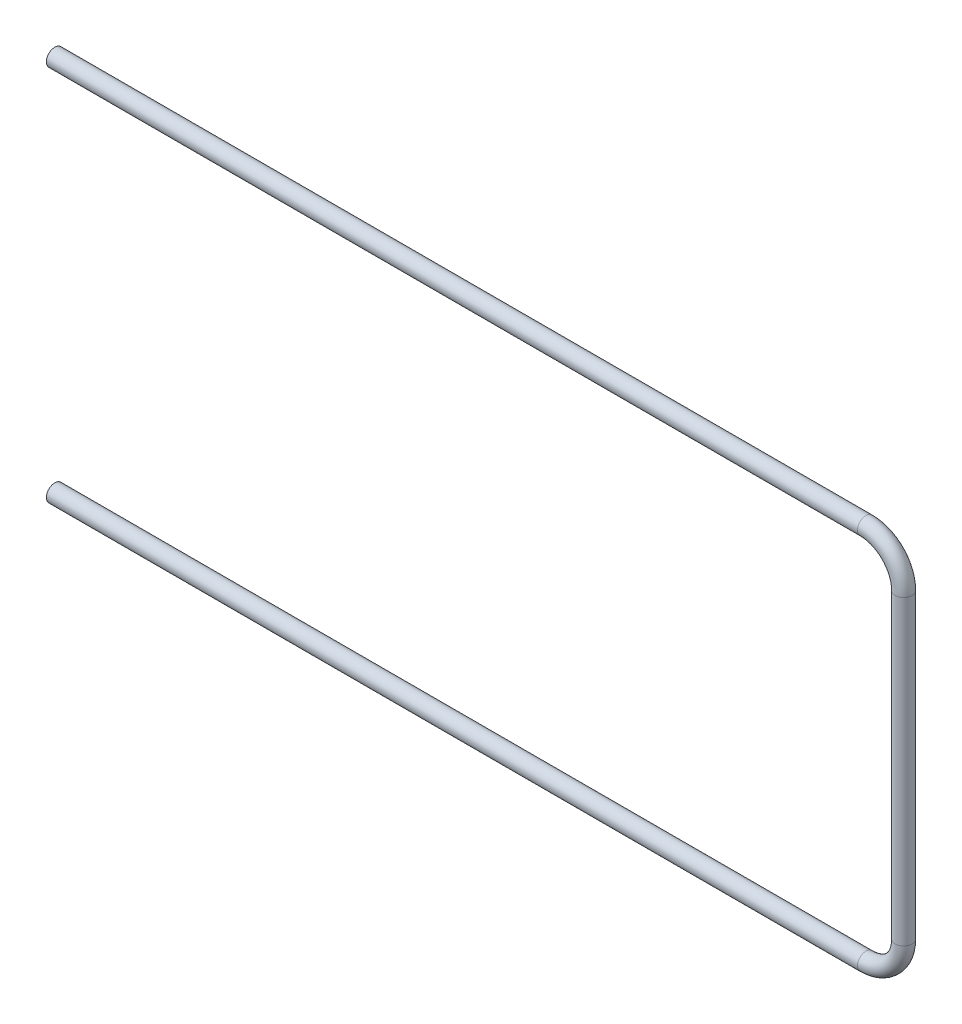
ISO-10303-21;
HEADER;
FILE_DESCRIPTION(('STEP AP214'),'2;1');
FILE_NAME('part.step','',(''),(''),'','','');
FILE_SCHEMA(('AUTOMOTIVE_DESIGN { 1 0 10303 214 1 1 1 1 }'));
ENDSEC;
DATA;
#1=APPLICATION_CONTEXT('core data for automotive mechanical design processes');
#2=APPLICATION_PROTOCOL_DEFINITION('international standard','automotive_design',2000,#1);
#3=PRODUCT_CONTEXT('',#1,'mechanical');
#4=PRODUCT('Part','Part','',(#3));
#5=PRODUCT_RELATED_PRODUCT_CATEGORY('part','',(#4));
#6=PRODUCT_DEFINITION_FORMATION('','',#4);
#7=PRODUCT_DEFINITION_CONTEXT('part definition',#1,'design');
#8=PRODUCT_DEFINITION('design','',#6,#7);
#9=PRODUCT_DEFINITION_SHAPE('','',#8);
#10=(LENGTH_UNIT() NAMED_UNIT(*) SI_UNIT(.MILLI.,.METRE.));
#11=(NAMED_UNIT(*) PLANE_ANGLE_UNIT() SI_UNIT($,.RADIAN.));
#12=(NAMED_UNIT(*) SI_UNIT($,.STERADIAN.) SOLID_ANGLE_UNIT());
#13=UNCERTAINTY_MEASURE_WITH_UNIT(LENGTH_MEASURE(1.E-05),#10,'distance_accuracy_value','');
#14=(GEOMETRIC_REPRESENTATION_CONTEXT(3) GLOBAL_UNCERTAINTY_ASSIGNED_CONTEXT((#13)) GLOBAL_UNIT_ASSIGNED_CONTEXT((#10,
#11,#12)) REPRESENTATION_CONTEXT('',''));
#15=CARTESIAN_POINT('',(0.,0.,0.));
#16=DIRECTION('',(0.,0.,1.));
#17=DIRECTION('',(1.,0.,0.));
#18=AXIS2_PLACEMENT_3D('',#15,#16,#17);
#19=CARTESIAN_POINT('',(430.,-200.,0.));
#20=DIRECTION('',(-1.,0.,0.));
#21=DIRECTION('',(0.,-1.,0.));
#22=AXIS2_PLACEMENT_3D('',#19,#20,#21);
#23=CYLINDRICAL_SURFACE('',#22,4.5);
#24=CARTESIAN_POINT('',(430.,-200.,0.));
#25=DIRECTION('',(-1.,0.,0.));
#26=DIRECTION('',(0.,0.,-1.));
#27=AXIS2_PLACEMENT_3D('',#24,#25,#26);
#28=CIRCLE('',#27,4.5);
#29=CARTESIAN_POINT('',(430.,-204.5,0.));
#30=VERTEX_POINT('',#29);
#31=EDGE_CURVE('E50',#30,#30,#28,.T.);
#32=ORIENTED_EDGE('',*,*,#31,.T.);
#33=EDGE_LOOP('',(#32));
#34=FACE_BOUND('',#33,.T.);
#35=CARTESIAN_POINT('',(0.,-200.,0.));
#36=DIRECTION('',(-1.,0.,0.));
#37=DIRECTION('',(0.,0.,-1.));
#38=AXIS2_PLACEMENT_3D('',#35,#36,#37);
#39=CIRCLE('',#38,4.5);
#40=CARTESIAN_POINT('',(0.,-200.,-4.5));
#41=VERTEX_POINT('',#40);
#42=EDGE_CURVE('E12',#41,#41,#39,.T.);
#43=ORIENTED_EDGE('',*,*,#42,.F.);
#44=EDGE_LOOP('',(#43));
#45=FACE_BOUND('',#44,.T.);
#46=ADVANCED_FACE('F40',(#34,#45),#23,.T.);
#47=CARTESIAN_POINT('',(430.,-200.,0.));
#48=DIRECTION('',(-1.,0.,0.));
#49=DIRECTION('',(0.,-1.,0.));
#50=AXIS2_PLACEMENT_3D('',#47,#48,#49);
#51=CYLINDRICAL_SURFACE('',#50,2.5);
#52=CARTESIAN_POINT('',(430.,-200.,0.));
#53=DIRECTION('',(-1.,0.,0.));
#54=DIRECTION('',(0.,0.,-1.));
#55=AXIS2_PLACEMENT_3D('',#52,#53,#54);
#56=CIRCLE('',#55,2.5);
#57=CARTESIAN_POINT('',(430.,-202.5,0.));
#58=VERTEX_POINT('',#57);
#59=EDGE_CURVE('E54',#58,#58,#56,.T.);
#60=ORIENTED_EDGE('',*,*,#59,.F.);
#61=EDGE_LOOP('',(#60));
#62=FACE_BOUND('',#61,.T.);
#63=CARTESIAN_POINT('',(0.,-200.,0.));
#64=DIRECTION('',(-1.,0.,0.));
#65=DIRECTION('',(0.,0.,-1.));
#66=AXIS2_PLACEMENT_3D('',#63,#64,#65);
#67=CIRCLE('',#66,2.5);
#68=CARTESIAN_POINT('',(0.,-200.,-2.5));
#69=VERTEX_POINT('',#68);
#70=EDGE_CURVE('E46',#69,#69,#67,.T.);
#71=ORIENTED_EDGE('',*,*,#70,.T.);
#72=EDGE_LOOP('',(#71));
#73=FACE_BOUND('',#72,.T.);
#74=ADVANCED_FACE('F108',(#62,#73),#51,.F.);
#75=CARTESIAN_POINT('',(430.,-180.,0.));
#76=DIRECTION('',(0.,0.,-1.));
#77=DIRECTION('',(-1.,0.,0.));
#78=AXIS2_PLACEMENT_3D('',#75,#76,#77);
#79=TOROIDAL_SURFACE('',#78,20.,4.5);
#80=CARTESIAN_POINT('',(450.,-180.,0.));
#81=DIRECTION('',(0.,-1.,0.));
#82=DIRECTION('',(0.,0.,-1.));
#83=AXIS2_PLACEMENT_3D('',#80,#81,#82);
#84=CIRCLE('',#83,4.5);
#85=CARTESIAN_POINT('',(454.5,-180.,0.));
#86=VERTEX_POINT('',#85);
#87=EDGE_CURVE('E59',#86,#86,#84,.T.);
#88=CARTESIAN_POINT('',(430.,-180.,0.));
#89=DIRECTION('',(0.,0.,-1.));
#90=DIRECTION('',(-1.,0.,0.));
#91=AXIS2_PLACEMENT_3D('',#88,#89,#90);
#92=CIRCLE('',#91,24.5);
#93=EDGE_CURVE('',#86,#30,#92,.T.);
#94=ORIENTED_EDGE('',*,*,#87,.T.);
#95=ORIENTED_EDGE('',*,*,#31,.F.);
#96=ORIENTED_EDGE('',*,*,#93,.T.);
#97=ORIENTED_EDGE('',*,*,#93,.F.);
#98=EDGE_LOOP('',(#94,#96,#95,#97));
#99=FACE_BOUND('',#98,.T.);
#100=ADVANCED_FACE('F104',(#99),#79,.T.);
#101=CARTESIAN_POINT('',(430.,-180.,0.));
#102=DIRECTION('',(0.,0.,-1.));
#103=DIRECTION('',(-1.,0.,0.));
#104=AXIS2_PLACEMENT_3D('',#101,#102,#103);
#105=TOROIDAL_SURFACE('',#104,20.,2.5);
#106=CARTESIAN_POINT('',(450.,-180.,0.));
#107=DIRECTION('',(0.,-1.,0.));
#108=DIRECTION('',(0.,0.,-1.));
#109=AXIS2_PLACEMENT_3D('',#106,#107,#108);
#110=CIRCLE('',#109,2.5);
#111=CARTESIAN_POINT('',(452.5,-180.,0.));
#112=VERTEX_POINT('',#111);
#113=EDGE_CURVE('E62',#112,#112,#110,.T.);
#114=CARTESIAN_POINT('',(430.,-180.,0.));
#115=DIRECTION('',(0.,0.,-1.));
#116=DIRECTION('',(-1.,0.,0.));
#117=AXIS2_PLACEMENT_3D('',#114,#115,#116);
#118=CIRCLE('',#117,22.5);
#119=EDGE_CURVE('',#112,#58,#118,.T.);
#120=ORIENTED_EDGE('',*,*,#113,.F.);
#121=ORIENTED_EDGE('',*,*,#59,.T.);
#122=ORIENTED_EDGE('',*,*,#119,.T.);
#123=ORIENTED_EDGE('',*,*,#119,.F.);
#124=EDGE_LOOP('',(#120,#122,#121,#123));
#125=FACE_BOUND('',#124,.T.);
#126=ADVANCED_FACE('F101',(#125),#105,.F.);
#127=CARTESIAN_POINT('',(450.,-20.,0.));
#128=DIRECTION('',(0.,-1.,0.));
#129=DIRECTION('',(1.,0.,0.));
#130=AXIS2_PLACEMENT_3D('',#127,#128,#129);
#131=CYLINDRICAL_SURFACE('',#130,4.5);
#132=CARTESIAN_POINT('',(450.,-20.,0.));
#133=DIRECTION('',(0.,-1.,0.));
#134=DIRECTION('',(0.,0.,-1.));
#135=AXIS2_PLACEMENT_3D('',#132,#133,#134);
#136=CIRCLE('',#135,4.5);
#137=CARTESIAN_POINT('',(454.5,-20.,0.));
#138=VERTEX_POINT('',#137);
#139=EDGE_CURVE('E65',#138,#138,#136,.T.);
#140=ORIENTED_EDGE('',*,*,#139,.T.);
#141=EDGE_LOOP('',(#140));
#142=FACE_BOUND('',#141,.T.);
#143=ORIENTED_EDGE('',*,*,#87,.F.);
#144=EDGE_LOOP('',(#143));
#145=FACE_BOUND('',#144,.T.);
#146=ADVANCED_FACE('F97',(#142,#145),#131,.T.);
#147=CARTESIAN_POINT('',(450.,-20.,0.));
#148=DIRECTION('',(0.,-1.,0.));
#149=DIRECTION('',(1.,0.,0.));
#150=AXIS2_PLACEMENT_3D('',#147,#148,#149);
#151=CYLINDRICAL_SURFACE('',#150,2.5);
#152=CARTESIAN_POINT('',(450.,-20.,0.));
#153=DIRECTION('',(0.,-1.,0.));
#154=DIRECTION('',(0.,0.,-1.));
#155=AXIS2_PLACEMENT_3D('',#152,#153,#154);
#156=CIRCLE('',#155,2.5);
#157=CARTESIAN_POINT('',(452.5,-20.,0.));
#158=VERTEX_POINT('',#157);
#159=EDGE_CURVE('E68',#158,#158,#156,.T.);
#160=ORIENTED_EDGE('',*,*,#159,.F.);
#161=EDGE_LOOP('',(#160));
#162=FACE_BOUND('',#161,.T.);
#163=ORIENTED_EDGE('',*,*,#113,.T.);
#164=EDGE_LOOP('',(#163));
#165=FACE_BOUND('',#164,.T.);
#166=ADVANCED_FACE('F94',(#162,#165),#151,.F.);
#167=CARTESIAN_POINT('',(430.,-20.,0.));
#168=DIRECTION('',(0.,0.,-1.));
#169=DIRECTION('',(-1.,0.,0.));
#170=AXIS2_PLACEMENT_3D('',#167,#168,#169);
#171=TOROIDAL_SURFACE('',#170,20.,4.5);
#172=CARTESIAN_POINT('',(430.,0.,0.));
#173=DIRECTION('',(1.,0.,0.));
#174=DIRECTION('',(0.,0.,-1.));
#175=AXIS2_PLACEMENT_3D('',#172,#173,#174);
#176=CIRCLE('',#175,4.5);
#177=CARTESIAN_POINT('',(430.,4.5,0.));
#178=VERTEX_POINT('',#177);
#179=EDGE_CURVE('E71',#178,#178,#176,.T.);
#180=CARTESIAN_POINT('',(430.,-20.,0.));
#181=DIRECTION('',(0.,0.,-1.));
#182=DIRECTION('',(-1.,0.,0.));
#183=AXIS2_PLACEMENT_3D('',#180,#181,#182);
#184=CIRCLE('',#183,24.5);
#185=EDGE_CURVE('',#178,#138,#184,.T.);
#186=ORIENTED_EDGE('',*,*,#179,.T.);
#187=ORIENTED_EDGE('',*,*,#139,.F.);
#188=ORIENTED_EDGE('',*,*,#185,.T.);
#189=ORIENTED_EDGE('',*,*,#185,.F.);
#190=EDGE_LOOP('',(#186,#188,#187,#189));
#191=FACE_BOUND('',#190,.T.);
#192=ADVANCED_FACE('F90',(#191),#171,.T.);
#193=CARTESIAN_POINT('',(430.,-20.,0.));
#194=DIRECTION('',(0.,0.,-1.));
#195=DIRECTION('',(-1.,0.,0.));
#196=AXIS2_PLACEMENT_3D('',#193,#194,#195);
#197=TOROIDAL_SURFACE('',#196,20.,2.5);
#198=CARTESIAN_POINT('',(430.,0.,0.));
#199=DIRECTION('',(1.,0.,0.));
#200=DIRECTION('',(0.,0.,-1.));
#201=AXIS2_PLACEMENT_3D('',#198,#199,#200);
#202=CIRCLE('',#201,2.5);
#203=CARTESIAN_POINT('',(430.,2.5,0.));
#204=VERTEX_POINT('',#203);
#205=EDGE_CURVE('E75',#204,#204,#202,.T.);
#206=CARTESIAN_POINT('',(430.,-20.,0.));
#207=DIRECTION('',(0.,0.,-1.));
#208=DIRECTION('',(-1.,0.,0.));
#209=AXIS2_PLACEMENT_3D('',#206,#207,#208);
#210=CIRCLE('',#209,22.5);
#211=EDGE_CURVE('',#204,#158,#210,.T.);
#212=ORIENTED_EDGE('',*,*,#205,.F.);
#213=ORIENTED_EDGE('',*,*,#159,.T.);
#214=ORIENTED_EDGE('',*,*,#211,.T.);
#215=ORIENTED_EDGE('',*,*,#211,.F.);
#216=EDGE_LOOP('',(#212,#214,#213,#215));
#217=FACE_BOUND('',#216,.T.);
#218=ADVANCED_FACE('F87',(#217),#197,.F.);
#219=CARTESIAN_POINT('',(430.,0.,0.));
#220=DIRECTION('',(-1.,0.,0.));
#221=DIRECTION('',(0.,0.,1.));
#222=AXIS2_PLACEMENT_3D('',#219,#220,#221);
#223=CYLINDRICAL_SURFACE('',#222,2.5);
#224=ORIENTED_EDGE('',*,*,#205,.T.);
#225=EDGE_LOOP('',(#224));
#226=FACE_BOUND('',#225,.T.);
#227=CARTESIAN_POINT('',(0.,0.,0.));
#228=DIRECTION('',(1.,0.,0.));
#229=DIRECTION('',(0.,0.,-1.));
#230=AXIS2_PLACEMENT_3D('',#227,#228,#229);
#231=CIRCLE('',#230,2.5);
#232=CARTESIAN_POINT('',(0.,0.,-2.5));
#233=VERTEX_POINT('',#232);
#234=EDGE_CURVE('E76',#233,#233,#231,.T.);
#235=ORIENTED_EDGE('',*,*,#234,.F.);
#236=EDGE_LOOP('',(#235));
#237=FACE_BOUND('',#236,.T.);
#238=ADVANCED_FACE('F84',(#226,#237),#223,.F.);
#239=CARTESIAN_POINT('',(430.,0.,0.));
#240=DIRECTION('',(-1.,0.,0.));
#241=DIRECTION('',(0.,0.,1.));
#242=AXIS2_PLACEMENT_3D('',#239,#240,#241);
#243=CYLINDRICAL_SURFACE('',#242,4.5);
#244=ORIENTED_EDGE('',*,*,#179,.F.);
#245=EDGE_LOOP('',(#244));
#246=FACE_BOUND('',#245,.T.);
#247=CARTESIAN_POINT('',(0.,0.,0.));
#248=DIRECTION('',(1.,0.,0.));
#249=DIRECTION('',(0.,0.,-1.));
#250=AXIS2_PLACEMENT_3D('',#247,#248,#249);
#251=CIRCLE('',#250,4.5);
#252=CARTESIAN_POINT('',(0.,0.,-4.5));
#253=VERTEX_POINT('',#252);
#254=EDGE_CURVE('E72',#253,#253,#251,.T.);
#255=ORIENTED_EDGE('',*,*,#254,.T.);
#256=EDGE_LOOP('',(#255));
#257=FACE_BOUND('',#256,.T.);
#258=ADVANCED_FACE('F126',(#246,#257),#243,.T.);
#259=CARTESIAN_POINT('',(0.,-200.,0.));
#260=DIRECTION('',(-1.,0.,0.));
#261=DIRECTION('',(0.,0.,-1.));
#262=AXIS2_PLACEMENT_3D('',#259,#260,#261);
#263=PLANE('',#262);
#264=ORIENTED_EDGE('',*,*,#70,.F.);
#265=EDGE_LOOP('',(#264));
#266=FACE_BOUND('',#265,.T.);
#267=ORIENTED_EDGE('',*,*,#42,.T.);
#268=EDGE_LOOP('',(#267));
#269=FACE_BOUND('',#268,.T.);
#270=ADVANCED_FACE('F129',(#266,#269),#263,.T.);
#271=CARTESIAN_POINT('',(0.,0.,0.));
#272=DIRECTION('',(1.,0.,0.));
#273=DIRECTION('',(0.,0.,-1.));
#274=AXIS2_PLACEMENT_3D('',#271,#272,#273);
#275=PLANE('',#274);
#276=ORIENTED_EDGE('',*,*,#234,.T.);
#277=EDGE_LOOP('',(#276));
#278=FACE_BOUND('',#277,.T.);
#279=ORIENTED_EDGE('',*,*,#254,.F.);
#280=EDGE_LOOP('',(#279));
#281=FACE_BOUND('',#280,.T.);
#282=ADVANCED_FACE('F131',(#278,#281),#275,.F.);
#283=CLOSED_SHELL('',(#46,#74,#100,#126,#146,#166,#192,#218,#238,#258,#270,#282));
#284=MANIFOLD_SOLID_BREP('B2',#283);
#285=ADVANCED_BREP_SHAPE_REPRESENTATION('',(#18,#284),#14);
#286=SHAPE_DEFINITION_REPRESENTATION(#9,#285);
ENDSEC;
END-ISO-10303-21;
